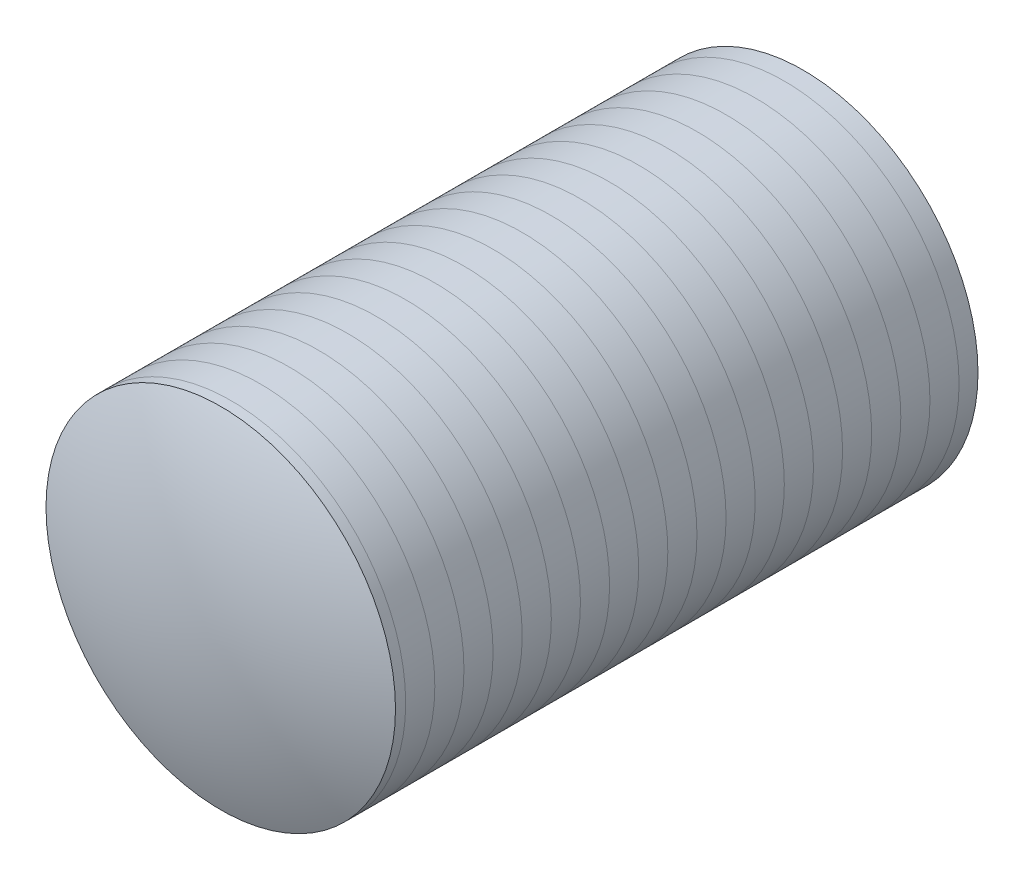
ISO-10303-21;
HEADER;
FILE_DESCRIPTION(('STEP AP214'),'2;1');
FILE_NAME('part.step','',(''),(''),'','','');
FILE_SCHEMA(('AUTOMOTIVE_DESIGN { 1 0 10303 214 1 1 1 1 }'));
ENDSEC;
DATA;
#1=APPLICATION_CONTEXT('core data for automotive mechanical design processes');
#2=APPLICATION_PROTOCOL_DEFINITION('international standard','automotive_design',2000,#1);
#3=PRODUCT_CONTEXT('',#1,'mechanical');
#4=PRODUCT('Part','Part','',(#3));
#5=PRODUCT_RELATED_PRODUCT_CATEGORY('part','',(#4));
#6=PRODUCT_DEFINITION_FORMATION('','',#4);
#7=PRODUCT_DEFINITION_CONTEXT('part definition',#1,'design');
#8=PRODUCT_DEFINITION('design','',#6,#7);
#9=PRODUCT_DEFINITION_SHAPE('','',#8);
#10=(LENGTH_UNIT() NAMED_UNIT(*) SI_UNIT(.MILLI.,.METRE.));
#11=(NAMED_UNIT(*) PLANE_ANGLE_UNIT() SI_UNIT($,.RADIAN.));
#12=(NAMED_UNIT(*) SI_UNIT($,.STERADIAN.) SOLID_ANGLE_UNIT());
#13=UNCERTAINTY_MEASURE_WITH_UNIT(LENGTH_MEASURE(1.E-05),#10,'distance_accuracy_value','');
#14=(GEOMETRIC_REPRESENTATION_CONTEXT(3) GLOBAL_UNCERTAINTY_ASSIGNED_CONTEXT((#13)) GLOBAL_UNIT_ASSIGNED_CONTEXT((#10,
#11,#12)) REPRESENTATION_CONTEXT('',''));
#15=CARTESIAN_POINT('',(0.,0.,0.));
#16=DIRECTION('',(0.,0.,1.));
#17=DIRECTION('',(1.,0.,0.));
#18=AXIS2_PLACEMENT_3D('',#15,#16,#17);
#19=CARTESIAN_POINT('',(0.,0.,20000.));
#20=DIRECTION('',(0.,0.,-1.));
#21=DIRECTION('',(-1.,0.,0.));
#22=AXIS2_PLACEMENT_3D('',#19,#20,#21);
#23=CYLINDRICAL_SURFACE('',#22,6000.);
#24=CARTESIAN_POINT('',(0.,0.,18650.0673650906));
#25=DIRECTION('',(0.,0.,1.));
#26=DIRECTION('',(1.,0.,0.));
#27=AXIS2_PLACEMENT_3D('',#24,#25,#26);
#28=CIRCLE('',#27,6000.);
#29=CARTESIAN_POINT('',(6000.,0.,18650.0673650906));
#30=VERTEX_POINT('',#29);
#31=EDGE_CURVE('E41',#30,#30,#28,.T.);
#32=ORIENTED_EDGE('',*,*,#31,.T.);
#33=EDGE_LOOP('',(#32));
#34=FACE_BOUND('',#33,.T.);
#35=CARTESIAN_POINT('',(0.,0.,19650.0673650906));
#36=DIRECTION('',(0.,0.,1.));
#37=DIRECTION('',(1.,0.,0.));
#38=AXIS2_PLACEMENT_3D('',#35,#36,#37);
#39=CIRCLE('',#38,6000.);
#40=CARTESIAN_POINT('',(6000.,0.,19650.0673650906));
#41=VERTEX_POINT('',#40);
#42=EDGE_CURVE('E10',#41,#41,#39,.T.);
#43=ORIENTED_EDGE('',*,*,#42,.F.);
#44=EDGE_LOOP('',(#43));
#45=FACE_BOUND('',#44,.T.);
#46=ADVANCED_FACE('F33',(#34,#45),#23,.T.);
#47=CARTESIAN_POINT('',(0.,0.,17650.0673650906));
#48=DIRECTION('',(0.,0.,1.));
#49=DIRECTION('',(1.,0.,0.));
#50=AXIS2_PLACEMENT_3D('',#47,#48,#49);
#51=CIRCLE('',#50,6000.);
#52=CARTESIAN_POINT('',(6000.,0.,17650.0673650906));
#53=VERTEX_POINT('',#52);
#54=EDGE_CURVE('E48',#53,#53,#51,.T.);
#55=ORIENTED_EDGE('',*,*,#54,.T.);
#56=EDGE_LOOP('',(#55));
#57=FACE_BOUND('',#56,.T.);
#58=ORIENTED_EDGE('',*,*,#31,.F.);
#59=EDGE_LOOP('',(#58));
#60=FACE_BOUND('',#59,.T.);
#61=ADVANCED_FACE('F145',(#57,#60),#23,.T.);
#62=CARTESIAN_POINT('',(0.,0.,16650.0673650906));
#63=DIRECTION('',(0.,0.,1.));
#64=DIRECTION('',(1.,0.,0.));
#65=AXIS2_PLACEMENT_3D('',#62,#63,#64);
#66=CIRCLE('',#65,6000.);
#67=CARTESIAN_POINT('',(6000.,0.,16650.0673650906));
#68=VERTEX_POINT('',#67);
#69=EDGE_CURVE('E55',#68,#68,#66,.T.);
#70=ORIENTED_EDGE('',*,*,#69,.T.);
#71=EDGE_LOOP('',(#70));
#72=FACE_BOUND('',#71,.T.);
#73=ORIENTED_EDGE('',*,*,#54,.F.);
#74=EDGE_LOOP('',(#73));
#75=FACE_BOUND('',#74,.T.);
#76=ADVANCED_FACE('F150',(#72,#75),#23,.T.);
#77=CARTESIAN_POINT('',(0.,0.,15650.0673650906));
#78=DIRECTION('',(0.,0.,1.));
#79=DIRECTION('',(1.,0.,0.));
#80=AXIS2_PLACEMENT_3D('',#77,#78,#79);
#81=CIRCLE('',#80,6000.);
#82=CARTESIAN_POINT('',(6000.,0.,15650.0673650906));
#83=VERTEX_POINT('',#82);
#84=EDGE_CURVE('E61',#83,#83,#81,.T.);
#85=ORIENTED_EDGE('',*,*,#84,.T.);
#86=EDGE_LOOP('',(#85));
#87=FACE_BOUND('',#86,.T.);
#88=ORIENTED_EDGE('',*,*,#69,.F.);
#89=EDGE_LOOP('',(#88));
#90=FACE_BOUND('',#89,.T.);
#91=ADVANCED_FACE('F238',(#87,#90),#23,.T.);
#92=CARTESIAN_POINT('',(0.,0.,14650.0673650906));
#93=DIRECTION('',(0.,0.,1.));
#94=DIRECTION('',(1.,0.,0.));
#95=AXIS2_PLACEMENT_3D('',#92,#93,#94);
#96=CIRCLE('',#95,6000.);
#97=CARTESIAN_POINT('',(6000.,0.,14650.0673650906));
#98=VERTEX_POINT('',#97);
#99=EDGE_CURVE('E65',#98,#98,#96,.T.);
#100=ORIENTED_EDGE('',*,*,#99,.T.);
#101=EDGE_LOOP('',(#100));
#102=FACE_BOUND('',#101,.T.);
#103=ORIENTED_EDGE('',*,*,#84,.F.);
#104=EDGE_LOOP('',(#103));
#105=FACE_BOUND('',#104,.T.);
#106=ADVANCED_FACE('F233',(#102,#105),#23,.T.);
#107=CARTESIAN_POINT('',(0.,0.,13650.0673650906));
#108=DIRECTION('',(0.,0.,1.));
#109=DIRECTION('',(1.,0.,0.));
#110=AXIS2_PLACEMENT_3D('',#107,#108,#109);
#111=CIRCLE('',#110,6000.);
#112=CARTESIAN_POINT('',(6000.,0.,13650.0673650906));
#113=VERTEX_POINT('',#112);
#114=EDGE_CURVE('E69',#113,#113,#111,.T.);
#115=ORIENTED_EDGE('',*,*,#114,.T.);
#116=EDGE_LOOP('',(#115));
#117=FACE_BOUND('',#116,.T.);
#118=ORIENTED_EDGE('',*,*,#99,.F.);
#119=EDGE_LOOP('',(#118));
#120=FACE_BOUND('',#119,.T.);
#121=ADVANCED_FACE('F228',(#117,#120),#23,.T.);
#122=CARTESIAN_POINT('',(0.,0.,12650.0673650906));
#123=DIRECTION('',(0.,0.,1.));
#124=DIRECTION('',(1.,0.,0.));
#125=AXIS2_PLACEMENT_3D('',#122,#123,#124);
#126=CIRCLE('',#125,6000.);
#127=CARTESIAN_POINT('',(6000.,0.,12650.0673650906));
#128=VERTEX_POINT('',#127);
#129=EDGE_CURVE('E73',#128,#128,#126,.T.);
#130=ORIENTED_EDGE('',*,*,#129,.T.);
#131=EDGE_LOOP('',(#130));
#132=FACE_BOUND('',#131,.T.);
#133=ORIENTED_EDGE('',*,*,#114,.F.);
#134=EDGE_LOOP('',(#133));
#135=FACE_BOUND('',#134,.T.);
#136=ADVANCED_FACE('F223',(#132,#135),#23,.T.);
#137=CARTESIAN_POINT('',(0.,0.,11650.0673650906));
#138=DIRECTION('',(0.,0.,1.));
#139=DIRECTION('',(1.,0.,0.));
#140=AXIS2_PLACEMENT_3D('',#137,#138,#139);
#141=CIRCLE('',#140,6000.);
#142=CARTESIAN_POINT('',(6000.,0.,11650.0673650906));
#143=VERTEX_POINT('',#142);
#144=EDGE_CURVE('E77',#143,#143,#141,.T.);
#145=ORIENTED_EDGE('',*,*,#144,.T.);
#146=EDGE_LOOP('',(#145));
#147=FACE_BOUND('',#146,.T.);
#148=ORIENTED_EDGE('',*,*,#129,.F.);
#149=EDGE_LOOP('',(#148));
#150=FACE_BOUND('',#149,.T.);
#151=ADVANCED_FACE('F218',(#147,#150),#23,.T.);
#152=CARTESIAN_POINT('',(0.,0.,10650.0673650906));
#153=DIRECTION('',(0.,0.,1.));
#154=DIRECTION('',(1.,0.,0.));
#155=AXIS2_PLACEMENT_3D('',#152,#153,#154);
#156=CIRCLE('',#155,6000.);
#157=CARTESIAN_POINT('',(6000.,0.,10650.0673650906));
#158=VERTEX_POINT('',#157);
#159=EDGE_CURVE('E81',#158,#158,#156,.T.);
#160=ORIENTED_EDGE('',*,*,#159,.T.);
#161=EDGE_LOOP('',(#160));
#162=FACE_BOUND('',#161,.T.);
#163=ORIENTED_EDGE('',*,*,#144,.F.);
#164=EDGE_LOOP('',(#163));
#165=FACE_BOUND('',#164,.T.);
#166=ADVANCED_FACE('F213',(#162,#165),#23,.T.);
#167=CARTESIAN_POINT('',(0.,0.,9650.06736509058));
#168=DIRECTION('',(0.,0.,1.));
#169=DIRECTION('',(1.,0.,0.));
#170=AXIS2_PLACEMENT_3D('',#167,#168,#169);
#171=CIRCLE('',#170,6000.);
#172=CARTESIAN_POINT('',(6000.,0.,9650.06736509058));
#173=VERTEX_POINT('',#172);
#174=EDGE_CURVE('E85',#173,#173,#171,.T.);
#175=ORIENTED_EDGE('',*,*,#174,.T.);
#176=EDGE_LOOP('',(#175));
#177=FACE_BOUND('',#176,.T.);
#178=ORIENTED_EDGE('',*,*,#159,.F.);
#179=EDGE_LOOP('',(#178));
#180=FACE_BOUND('',#179,.T.);
#181=ADVANCED_FACE('F208',(#177,#180),#23,.T.);
#182=CARTESIAN_POINT('',(0.,0.,8650.06736509058));
#183=DIRECTION('',(0.,0.,1.));
#184=DIRECTION('',(1.,0.,0.));
#185=AXIS2_PLACEMENT_3D('',#182,#183,#184);
#186=CIRCLE('',#185,6000.);
#187=CARTESIAN_POINT('',(6000.,0.,8650.06736509058));
#188=VERTEX_POINT('',#187);
#189=EDGE_CURVE('E89',#188,#188,#186,.T.);
#190=ORIENTED_EDGE('',*,*,#189,.T.);
#191=EDGE_LOOP('',(#190));
#192=FACE_BOUND('',#191,.T.);
#193=ORIENTED_EDGE('',*,*,#174,.F.);
#194=EDGE_LOOP('',(#193));
#195=FACE_BOUND('',#194,.T.);
#196=ADVANCED_FACE('F203',(#192,#195),#23,.T.);
#197=CARTESIAN_POINT('',(0.,0.,7650.06736509058));
#198=DIRECTION('',(0.,0.,1.));
#199=DIRECTION('',(1.,0.,0.));
#200=AXIS2_PLACEMENT_3D('',#197,#198,#199);
#201=CIRCLE('',#200,6000.);
#202=CARTESIAN_POINT('',(6000.,0.,7650.06736509058));
#203=VERTEX_POINT('',#202);
#204=EDGE_CURVE('E93',#203,#203,#201,.T.);
#205=ORIENTED_EDGE('',*,*,#204,.T.);
#206=EDGE_LOOP('',(#205));
#207=FACE_BOUND('',#206,.T.);
#208=ORIENTED_EDGE('',*,*,#189,.F.);
#209=EDGE_LOOP('',(#208));
#210=FACE_BOUND('',#209,.T.);
#211=ADVANCED_FACE('F198',(#207,#210),#23,.T.);
#212=CARTESIAN_POINT('',(0.,0.,6650.06736509058));
#213=DIRECTION('',(0.,0.,1.));
#214=DIRECTION('',(1.,0.,0.));
#215=AXIS2_PLACEMENT_3D('',#212,#213,#214);
#216=CIRCLE('',#215,6000.);
#217=CARTESIAN_POINT('',(6000.,0.,6650.06736509058));
#218=VERTEX_POINT('',#217);
#219=EDGE_CURVE('E97',#218,#218,#216,.T.);
#220=ORIENTED_EDGE('',*,*,#219,.T.);
#221=EDGE_LOOP('',(#220));
#222=FACE_BOUND('',#221,.T.);
#223=ORIENTED_EDGE('',*,*,#204,.F.);
#224=EDGE_LOOP('',(#223));
#225=FACE_BOUND('',#224,.T.);
#226=ADVANCED_FACE('F193',(#222,#225),#23,.T.);
#227=CARTESIAN_POINT('',(0.,0.,5650.06736509058));
#228=DIRECTION('',(0.,0.,1.));
#229=DIRECTION('',(1.,0.,0.));
#230=AXIS2_PLACEMENT_3D('',#227,#228,#229);
#231=CIRCLE('',#230,6000.);
#232=CARTESIAN_POINT('',(6000.,0.,5650.06736509058));
#233=VERTEX_POINT('',#232);
#234=EDGE_CURVE('E101',#233,#233,#231,.T.);
#235=ORIENTED_EDGE('',*,*,#234,.T.);
#236=EDGE_LOOP('',(#235));
#237=FACE_BOUND('',#236,.T.);
#238=ORIENTED_EDGE('',*,*,#219,.F.);
#239=EDGE_LOOP('',(#238));
#240=FACE_BOUND('',#239,.T.);
#241=ADVANCED_FACE('F188',(#237,#240),#23,.T.);
#242=CARTESIAN_POINT('',(0.,0.,4650.06736509058));
#243=DIRECTION('',(0.,0.,1.));
#244=DIRECTION('',(1.,0.,0.));
#245=AXIS2_PLACEMENT_3D('',#242,#243,#244);
#246=CIRCLE('',#245,6000.);
#247=CARTESIAN_POINT('',(6000.,0.,4650.06736509058));
#248=VERTEX_POINT('',#247);
#249=EDGE_CURVE('E105',#248,#248,#246,.T.);
#250=ORIENTED_EDGE('',*,*,#249,.T.);
#251=EDGE_LOOP('',(#250));
#252=FACE_BOUND('',#251,.T.);
#253=ORIENTED_EDGE('',*,*,#234,.F.);
#254=EDGE_LOOP('',(#253));
#255=FACE_BOUND('',#254,.T.);
#256=ADVANCED_FACE('F183',(#252,#255),#23,.T.);
#257=CARTESIAN_POINT('',(0.,0.,3650.06736509058));
#258=DIRECTION('',(0.,0.,1.));
#259=DIRECTION('',(1.,0.,0.));
#260=AXIS2_PLACEMENT_3D('',#257,#258,#259);
#261=CIRCLE('',#260,6000.);
#262=CARTESIAN_POINT('',(6000.,0.,3650.06736509058));
#263=VERTEX_POINT('',#262);
#264=EDGE_CURVE('E109',#263,#263,#261,.T.);
#265=ORIENTED_EDGE('',*,*,#264,.T.);
#266=EDGE_LOOP('',(#265));
#267=FACE_BOUND('',#266,.T.);
#268=ORIENTED_EDGE('',*,*,#249,.F.);
#269=EDGE_LOOP('',(#268));
#270=FACE_BOUND('',#269,.T.);
#271=ADVANCED_FACE('F178',(#267,#270),#23,.T.);
#272=CARTESIAN_POINT('',(0.,0.,2650.06736509058));
#273=DIRECTION('',(0.,0.,1.));
#274=DIRECTION('',(1.,0.,0.));
#275=AXIS2_PLACEMENT_3D('',#272,#273,#274);
#276=CIRCLE('',#275,6000.);
#277=CARTESIAN_POINT('',(6000.,0.,2650.06736509058));
#278=VERTEX_POINT('',#277);
#279=EDGE_CURVE('E113',#278,#278,#276,.T.);
#280=ORIENTED_EDGE('',*,*,#279,.T.);
#281=EDGE_LOOP('',(#280));
#282=FACE_BOUND('',#281,.T.);
#283=ORIENTED_EDGE('',*,*,#264,.F.);
#284=EDGE_LOOP('',(#283));
#285=FACE_BOUND('',#284,.T.);
#286=ADVANCED_FACE('F168',(#282,#285),#23,.T.);
#287=CARTESIAN_POINT('',(0.,0.,1650.06736509058));
#288=DIRECTION('',(0.,0.,1.));
#289=DIRECTION('',(1.,0.,0.));
#290=AXIS2_PLACEMENT_3D('',#287,#288,#289);
#291=CIRCLE('',#290,6000.);
#292=CARTESIAN_POINT('',(6000.,0.,1650.06736509058));
#293=VERTEX_POINT('',#292);
#294=EDGE_CURVE('E117',#293,#293,#291,.T.);
#295=ORIENTED_EDGE('',*,*,#294,.T.);
#296=EDGE_LOOP('',(#295));
#297=FACE_BOUND('',#296,.T.);
#298=ORIENTED_EDGE('',*,*,#279,.F.);
#299=EDGE_LOOP('',(#298));
#300=FACE_BOUND('',#299,.T.);
#301=ADVANCED_FACE('F163',(#297,#300),#23,.T.);
#302=CARTESIAN_POINT('',(0.,0.,650.067365090582));
#303=DIRECTION('',(0.,0.,1.));
#304=DIRECTION('',(1.,0.,0.));
#305=AXIS2_PLACEMENT_3D('',#302,#303,#304);
#306=CIRCLE('',#305,6000.);
#307=CARTESIAN_POINT('',(6000.,0.,650.067365090582));
#308=VERTEX_POINT('',#307);
#309=EDGE_CURVE('E121',#308,#308,#306,.T.);
#310=ORIENTED_EDGE('',*,*,#309,.T.);
#311=EDGE_LOOP('',(#310));
#312=FACE_BOUND('',#311,.T.);
#313=ORIENTED_EDGE('',*,*,#294,.F.);
#314=EDGE_LOOP('',(#313));
#315=FACE_BOUND('',#314,.T.);
#316=ADVANCED_FACE('F157',(#312,#315),#23,.T.);
#317=CARTESIAN_POINT('',(0.,0.,0.));
#318=DIRECTION('',(0.,0.,1.));
#319=DIRECTION('',(1.,0.,0.));
#320=AXIS2_PLACEMENT_3D('',#317,#318,#319);
#321=CIRCLE('',#320,6000.);
#322=CARTESIAN_POINT('',(6000.,0.,0.));
#323=VERTEX_POINT('',#322);
#324=EDGE_CURVE('E128',#323,#323,#321,.T.);
#325=ORIENTED_EDGE('',*,*,#324,.T.);
#326=EDGE_LOOP('',(#325));
#327=FACE_BOUND('',#326,.T.);
#328=ORIENTED_EDGE('',*,*,#309,.F.);
#329=EDGE_LOOP('',(#328));
#330=FACE_BOUND('',#329,.T.);
#331=ADVANCED_FACE('F132',(#327,#330),#23,.T.);
#332=ORIENTED_EDGE('',*,*,#42,.T.);
#333=EDGE_LOOP('',(#332));
#334=FACE_BOUND('',#333,.T.);
#335=CARTESIAN_POINT('',(0.,0.,20000.));
#336=DIRECTION('',(0.,0.,1.));
#337=DIRECTION('',(1.,0.,0.));
#338=AXIS2_PLACEMENT_3D('',#335,#336,#337);
#339=CIRCLE('',#338,6000.);
#340=CARTESIAN_POINT('',(6000.,0.,20000.));
#341=VERTEX_POINT('',#340);
#342=EDGE_CURVE('E125',#341,#341,#339,.T.);
#343=ORIENTED_EDGE('',*,*,#342,.F.);
#344=EDGE_LOOP('',(#343));
#345=FACE_BOUND('',#344,.T.);
#346=ADVANCED_FACE('F142',(#334,#345),#23,.T.);
#347=CARTESIAN_POINT('',(0.,0.,5599.99999999999));
#348=DIRECTION('',(0.,0.,1.));
#349=DIRECTION('',(1.,0.,0.));
#350=AXIS2_PLACEMENT_3D('',#347,#348,#349);
#351=SPHERICAL_SURFACE('',#350,15600.);
#352=ORIENTED_EDGE('',*,*,#342,.T.);
#353=EDGE_LOOP('',(#352));
#354=FACE_BOUND('',#353,.T.);
#355=ADVANCED_FACE('F35',(#354),#351,.T.);
#356=CARTESIAN_POINT('',(0.,0.,0.));
#357=DIRECTION('',(0.,0.,1.));
#358=DIRECTION('',(1.,0.,0.));
#359=AXIS2_PLACEMENT_3D('',#356,#357,#358);
#360=PLANE('',#359);
#361=ORIENTED_EDGE('',*,*,#324,.F.);
#362=EDGE_LOOP('',(#361));
#363=FACE_BOUND('',#362,.T.);
#364=ADVANCED_FACE('F135',(#363),#360,.F.);
#365=CLOSED_SHELL('',(#46,#61,#76,#91,#106,#121,#136,#151,#166,#181,#196,#211,#226,#241,#256,
#271,#286,#301,#316,#331,#346,#355,#364));
#366=MANIFOLD_SOLID_BREP('B2',#365);
#367=ADVANCED_BREP_SHAPE_REPRESENTATION('',(#18,#366),#14);
#368=SHAPE_DEFINITION_REPRESENTATION(#9,#367);
ENDSEC;
END-ISO-10303-21;
